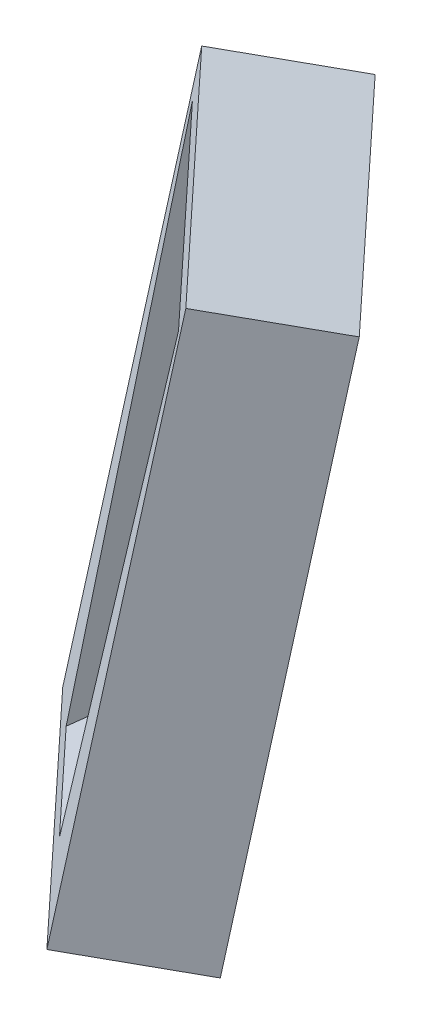
ISO-10303-21;
HEADER;
FILE_DESCRIPTION(('STEP AP214'),'2;1');
FILE_NAME('part.step','',(''),(''),'','','');
FILE_SCHEMA(('AUTOMOTIVE_DESIGN { 1 0 10303 214 1 1 1 1 }'));
ENDSEC;
DATA;
#1=APPLICATION_CONTEXT('core data for automotive mechanical design processes');
#2=APPLICATION_PROTOCOL_DEFINITION('international standard','automotive_design',2000,#1);
#3=PRODUCT_CONTEXT('',#1,'mechanical');
#4=PRODUCT('Part','Part','',(#3));
#5=PRODUCT_RELATED_PRODUCT_CATEGORY('part','',(#4));
#6=PRODUCT_DEFINITION_FORMATION('','',#4);
#7=PRODUCT_DEFINITION_CONTEXT('part definition',#1,'design');
#8=PRODUCT_DEFINITION('design','',#6,#7);
#9=PRODUCT_DEFINITION_SHAPE('','',#8);
#10=(LENGTH_UNIT() NAMED_UNIT(*) SI_UNIT(.MILLI.,.METRE.));
#11=(NAMED_UNIT(*) PLANE_ANGLE_UNIT() SI_UNIT($,.RADIAN.));
#12=(NAMED_UNIT(*) SI_UNIT($,.STERADIAN.) SOLID_ANGLE_UNIT());
#13=UNCERTAINTY_MEASURE_WITH_UNIT(LENGTH_MEASURE(1.E-05),#10,'distance_accuracy_value','');
#14=(GEOMETRIC_REPRESENTATION_CONTEXT(3) GLOBAL_UNCERTAINTY_ASSIGNED_CONTEXT((#13)) GLOBAL_UNIT_ASSIGNED_CONTEXT((#10,
#11,#12)) REPRESENTATION_CONTEXT('',''));
#15=CARTESIAN_POINT('',(0.,0.,0.));
#16=DIRECTION('',(0.,0.,1.));
#17=DIRECTION('',(1.,0.,0.));
#18=AXIS2_PLACEMENT_3D('',#15,#16,#17);
#19=CARTESIAN_POINT('',(18.6546782727136,-4.4975817974709,-17.3957689163492));
#20=DIRECTION('',(-0.720242795548749,0.173648177666931,0.671637272531146));
#21=DIRECTION('',(0.681998360062485,0.,0.731353701619184));
#22=AXIS2_PLACEMENT_3D('',#19,#20,#21);
#23=PLANE('',#22);
#24=DIRECTION('',(-0.126998237516135,-0.984807753012208,0.118427772396686));
#25=VECTOR('',#24,1.);
#26=CARTESIAN_POINT('',(-8.13275820855272,-83.6255594174478,-25.6636677477316));
#27=LINE('',#26,#25);
#28=CARTESIAN_POINT('',(3.40947598664339,5.87868839597211,-36.4269752624856));
#29=VERTEX_POINT('',#28);
#30=CARTESIAN_POINT('',(-8.13275820855272,-83.6255594174478,-25.6636677477316));
#31=VERTEX_POINT('',#30);
#32=EDGE_CURVE('E158',#29,#31,#27,.T.);
#33=ORIENTED_EDGE('',*,*,#32,.T.);
#34=DIRECTION('',(0.681998360062485,0.,0.731353701619183));
#35=VECTOR('',#34,1.);
#36=CARTESIAN_POINT('',(27.0697806010197,-83.6255594174478,12.0864333850847));
#37=LINE('',#36,#35);
#38=CARTESIAN_POINT('',(27.0697806010197,-83.6255594174478,12.0864333850847));
#39=VERTEX_POINT('',#38);
#40=EDGE_CURVE('E156',#31,#39,#37,.T.);
#41=ORIENTED_EDGE('',*,*,#40,.T.);
#42=DIRECTION('',(0.126998237516135,0.984807753012208,-0.118427772396686));
#43=VECTOR('',#42,1.);
#44=CARTESIAN_POINT('',(27.0697806010197,-83.6255594174478,12.0864333850847));
#45=LINE('',#44,#43);
#46=CARTESIAN_POINT('',(38.6120147962158,5.87868839597211,1.32312587033079));
#47=VERTEX_POINT('',#46);
#48=EDGE_CURVE('E154',#39,#47,#45,.T.);
#49=ORIENTED_EDGE('',*,*,#48,.T.);
#50=DIRECTION('',(-0.681998360062485,0.,-0.731353701619183));
#51=VECTOR('',#50,1.);
#52=CARTESIAN_POINT('',(38.6120147962158,5.87868839597211,1.32312587033079));
#53=LINE('',#52,#51);
#54=EDGE_CURVE('E125',#47,#29,#53,.T.);
#55=ORIENTED_EDGE('',*,*,#54,.T.);
#56=EDGE_LOOP('',(#33,#41,#49,#55));
#57=FACE_BOUND('',#56,.T.);
#58=DIRECTION('',(-0.681998360062485,0.,-0.731353701619184));
#59=VECTOR('',#58,1.);
#60=CARTESIAN_POINT('',(9.11646443948094,-78.4616549733872,-8.50124062205317));
#61=LINE('',#60,#59);
#62=CARTESIAN_POINT('',(17.6758311591867,-78.4616549733873,0.677556425786284));
#63=VERTEX_POINT('',#62);
#64=CARTESIAN_POINT('',(2.74526071646667,-78.4616549733872,-15.3335201398067));
#65=VERTEX_POINT('',#64);
#66=EDGE_CURVE('E118',#63,#65,#61,.T.);
#67=ORIENTED_EDGE('',*,*,#66,.T.);
#68=DIRECTION('',(0.0273368689251121,0.974517168416114,-0.222640930782305));
#69=VECTOR('',#68,1.);
#70=CARTESIAN_POINT('',(4.74012263099706,-7.34790783376903,-31.5803666477192));
#71=LINE('',#70,#69);
#72=CARTESIAN_POINT('',(4.96169586738922,0.550835929358898,-33.3849358440648));
#73=VERTEX_POINT('',#72);
#74=EDGE_CURVE('E124',#65,#73,#71,.T.);
#75=ORIENTED_EDGE('',*,*,#74,.T.);
#76=DIRECTION('',(-0.681998360062485,0.,-0.731353701619184));
#77=VECTOR('',#76,1.);
#78=CARTESIAN_POINT('',(19.3057090465794,0.550835929358901,-18.002864934519));
#79=LINE('',#78,#77);
#80=CARTESIAN_POINT('',(35.8378852224596,0.550835929358904,-0.274276494888895));
#81=VERTEX_POINT('',#80);
#82=EDGE_CURVE('E128',#81,#73,#79,.T.);
#83=ORIENTED_EDGE('',*,*,#82,.F.);
#84=DIRECTION('',(0.224005512244216,0.974517168416118,-0.0117396314438858));
#85=VECTOR('',#84,1.);
#86=CARTESIAN_POINT('',(33.918627764174,-7.79873245836392,-0.173692473627682));
#87=LINE('',#86,#85);
#88=EDGE_CURVE('E111',#63,#81,#87,.T.);
#89=ORIENTED_EDGE('',*,*,#88,.F.);
#90=EDGE_LOOP('',(#67,#75,#83,#89));
#91=FACE_BOUND('',#90,.T.);
#92=ADVANCED_FACE('F45',(#57,#91),#23,.T.);
#93=CARTESIAN_POINT('',(-8.13275820855272,-83.6255594174478,-25.6636677477316));
#94=DIRECTION('',(0.681998360062485,0.,0.731353701619183));
#95=DIRECTION('',(0.731353701619183,0.,-0.681998360062485));
#96=AXIS2_PLACEMENT_3D('',#93,#94,#95);
#97=PLANE('',#96);
#98=DIRECTION('',(-0.126998237516135,-0.984807753012208,0.118427772396686));
#99=VECTOR('',#98,1.);
#100=CARTESIAN_POINT('',(6.27209770242226,-87.0985229707865,-39.0964131983546));
#101=LINE('',#100,#99);
#102=CARTESIAN_POINT('',(17.8143318976184,2.4057248426335,-49.8597207131085));
#103=VERTEX_POINT('',#102);
#104=CARTESIAN_POINT('',(6.27209770242226,-87.0985229707865,-39.0964131983546));
#105=VERTEX_POINT('',#104);
#106=EDGE_CURVE('E147',#103,#105,#101,.T.);
#107=ORIENTED_EDGE('',*,*,#106,.T.);
#108=DIRECTION('',(0.720242795548749,-0.173648177666931,-0.671637272531146));
#109=VECTOR('',#108,1.);
#110=CARTESIAN_POINT('',(-8.13275820855272,-83.6255594174478,-25.6636677477316));
#111=LINE('',#110,#109);
#112=EDGE_CURVE('E136',#31,#105,#111,.T.);
#113=ORIENTED_EDGE('',*,*,#112,.F.);
#114=ORIENTED_EDGE('',*,*,#32,.F.);
#115=DIRECTION('',(0.720242795548749,-0.173648177666931,-0.671637272531146));
#116=VECTOR('',#115,1.);
#117=CARTESIAN_POINT('',(3.40947598664339,5.87868839597211,-36.4269752624856));
#118=LINE('',#117,#116);
#119=EDGE_CURVE('E144',#29,#103,#118,.T.);
#120=ORIENTED_EDGE('',*,*,#119,.T.);
#121=EDGE_LOOP('',(#107,#113,#114,#120));
#122=FACE_BOUND('',#121,.T.);
#123=ADVANCED_FACE('F193',(#122),#97,.F.);
#124=CARTESIAN_POINT('',(27.0697806010197,-83.6255594174478,12.0864333850847));
#125=DIRECTION('',(0.126998237516135,0.984807753012208,-0.118427772396686));
#126=DIRECTION('',(-0.991787288091737,0.127898300143659,0.));
#127=AXIS2_PLACEMENT_3D('',#124,#125,#126);
#128=PLANE('',#127);
#129=DIRECTION('',(0.681998360062485,0.,0.731353701619183));
#130=VECTOR('',#129,1.);
#131=CARTESIAN_POINT('',(41.4746365119946,-87.0985229707865,-1.34631206553818));
#132=LINE('',#131,#130);
#133=CARTESIAN_POINT('',(41.4746365119946,-87.0985229707865,-1.34631206553818));
#134=VERTEX_POINT('',#133);
#135=EDGE_CURVE('E140',#105,#134,#132,.T.);
#136=ORIENTED_EDGE('',*,*,#135,.T.);
#137=DIRECTION('',(0.720242795548749,-0.173648177666931,-0.671637272531146));
#138=VECTOR('',#137,1.);
#139=CARTESIAN_POINT('',(27.0697806010197,-83.6255594174478,12.0864333850847));
#140=LINE('',#139,#138);
#141=EDGE_CURVE('E141',#39,#134,#140,.T.);
#142=ORIENTED_EDGE('',*,*,#141,.F.);
#143=ORIENTED_EDGE('',*,*,#40,.F.);
#144=ORIENTED_EDGE('',*,*,#112,.T.);
#145=EDGE_LOOP('',(#136,#142,#143,#144));
#146=FACE_BOUND('',#145,.T.);
#147=ADVANCED_FACE('F198',(#146),#128,.F.);
#148=CARTESIAN_POINT('',(27.0697806010197,-83.6255594174478,12.0864333850847));
#149=DIRECTION('',(-0.681998360062485,0.,-0.731353701619183));
#150=DIRECTION('',(-0.731353701619183,0.,0.681998360062485));
#151=AXIS2_PLACEMENT_3D('',#148,#149,#150);
#152=PLANE('',#151);
#153=DIRECTION('',(0.126998237516135,0.984807753012208,-0.118427772396686));
#154=VECTOR('',#153,1.);
#155=CARTESIAN_POINT('',(41.4746365119946,-87.0985229707865,-1.34631206553818));
#156=LINE('',#155,#154);
#157=CARTESIAN_POINT('',(53.0168707071907,2.4057248426335,-12.1096195802921));
#158=VERTEX_POINT('',#157);
#159=EDGE_CURVE('E139',#134,#158,#156,.T.);
#160=ORIENTED_EDGE('',*,*,#159,.T.);
#161=DIRECTION('',(0.720242795548749,-0.173648177666931,-0.671637272531146));
#162=VECTOR('',#161,1.);
#163=CARTESIAN_POINT('',(38.6120147962158,5.87868839597211,1.32312587033079));
#164=LINE('',#163,#162);
#165=EDGE_CURVE('E129',#47,#158,#164,.T.);
#166=ORIENTED_EDGE('',*,*,#165,.F.);
#167=ORIENTED_EDGE('',*,*,#48,.F.);
#168=ORIENTED_EDGE('',*,*,#141,.T.);
#169=EDGE_LOOP('',(#160,#166,#167,#168));
#170=FACE_BOUND('',#169,.T.);
#171=ADVANCED_FACE('F212',(#170),#152,.F.);
#172=CARTESIAN_POINT('',(38.6120147962158,5.87868839597211,1.32312587033079));
#173=DIRECTION('',(-0.126998237516135,-0.984807753012208,0.118427772396686));
#174=DIRECTION('',(0.991787288091737,-0.127898300143659,0.));
#175=AXIS2_PLACEMENT_3D('',#172,#173,#174);
#176=PLANE('',#175);
#177=DIRECTION('',(-0.681998360062485,0.,-0.731353701619183));
#178=VECTOR('',#177,1.);
#179=CARTESIAN_POINT('',(53.0168707071907,2.4057248426335,-12.1096195802921));
#180=LINE('',#179,#178);
#181=EDGE_CURVE('E132',#158,#103,#180,.T.);
#182=ORIENTED_EDGE('',*,*,#181,.T.);
#183=ORIENTED_EDGE('',*,*,#119,.F.);
#184=ORIENTED_EDGE('',*,*,#54,.F.);
#185=ORIENTED_EDGE('',*,*,#165,.T.);
#186=EDGE_LOOP('',(#182,#183,#184,#185));
#187=FACE_BOUND('',#186,.T.);
#188=ADVANCED_FACE('F189',(#187),#176,.F.);
#189=CARTESIAN_POINT('',(33.0595341836886,-7.97054535080951,-30.8285143669722));
#190=DIRECTION('',(-0.720242795548749,0.173648177666931,0.671637272531146));
#191=DIRECTION('',(0.681998360062485,0.,0.731353701619184));
#192=AXIS2_PLACEMENT_3D('',#189,#190,#191);
#193=PLANE('',#192);
#194=ORIENTED_EDGE('',*,*,#106,.F.);
#195=ORIENTED_EDGE('',*,*,#181,.F.);
#196=ORIENTED_EDGE('',*,*,#159,.F.);
#197=ORIENTED_EDGE('',*,*,#135,.F.);
#198=EDGE_LOOP('',(#194,#195,#196,#197));
#199=FACE_BOUND('',#198,.T.);
#200=ADVANCED_FACE('F185',(#199),#193,.F.);
#201=CARTESIAN_POINT('',(0.669916928654261,0.550835929358902,1.56879862528684));
#202=DIRECTION('',(0.052335956242972,0.,0.998629534754573));
#203=DIRECTION('',(0.998629534754573,0.,-0.052335956242972));
#204=AXIS2_PLACEMENT_3D('',#201,#202,#203);
#205=PLANE('',#204);
#206=ORIENTED_EDGE('',*,*,#88,.T.);
#207=DIRECTION('',(-0.998629534754573,0.,0.052335956242972));
#208=VECTOR('',#207,1.);
#209=CARTESIAN_POINT('',(0.669916928654261,0.550835929358902,1.56879862528684));
#210=LINE('',#209,#208);
#211=CARTESIAN_POINT('',(36.9201690402453,0.550835929358902,-0.330996586333041));
#212=VERTEX_POINT('',#211);
#213=EDGE_CURVE('E163',#212,#81,#210,.T.);
#214=ORIENTED_EDGE('',*,*,#213,.F.);
#215=CARTESIAN_POINT('',(36.9201690402453,0.550835929358902,-0.330996586333041));
#216=CARTESIAN_POINT('',(36.850387354924,-32.7451296873358,-0.327339483170722));
#217=CARTESIAN_POINT('',(31.7627781825146,-60.3724010335655,-0.0607091845845709));
#218=CARTESIAN_POINT('',(21.2638484056439,-78.4616549733873,0.489516409870112));
#219=B_SPLINE_CURVE_WITH_KNOTS('',3,(#215,#216,#217,#218),.UNSPECIFIED.,.F.,.F.,(4,4),(0.,1.),.UNSPECIFIED.);
#220=CARTESIAN_POINT('',(21.2638484056439,-78.4616549733872,0.489516409870111));
#221=VERTEX_POINT('',#220);
#222=EDGE_CURVE('E48',#212,#221,#219,.T.);
#223=ORIENTED_EDGE('',*,*,#222,.T.);
#224=DIRECTION('',(-0.998629534754573,0.,0.052335956242972));
#225=VECTOR('',#224,1.);
#226=CARTESIAN_POINT('',(0.669916928654261,-78.4616549733872,1.56879862528684));
#227=LINE('',#226,#225);
#228=EDGE_CURVE('E106',#221,#63,#227,.T.);
#229=ORIENTED_EDGE('',*,*,#228,.T.);
#230=EDGE_LOOP('',(#206,#214,#223,#229));
#231=FACE_BOUND('',#230,.T.);
#232=ADVANCED_FACE('F108',(#231),#205,.F.);
#233=CARTESIAN_POINT('',(0.669916928654261,0.550835929358902,1.56879862528684));
#234=DIRECTION('',(0.992546151641326,0.,0.121869343405117));
#235=DIRECTION('',(0.121869343405117,0.,-0.992546151641326));
#236=AXIS2_PLACEMENT_3D('',#233,#234,#235);
#237=PLANE('',#236);
#238=DIRECTION('',(-0.121869343405117,0.,0.992546151641326));
#239=VECTOR('',#238,1.);
#240=CARTESIAN_POINT('',(0.669916928654269,-78.4616549733872,1.56879862528685));
#241=LINE('',#240,#239);
#242=CARTESIAN_POINT('',(3.18313010720051,-78.4616549733872,-18.8996801481502));
#243=VERTEX_POINT('',#242);
#244=EDGE_CURVE('E121',#243,#65,#241,.T.);
#245=ORIENTED_EDGE('',*,*,#244,.F.);
#246=CARTESIAN_POINT('',(5.09377409425999,0.550835929358898,-34.4606266792933));
#247=CARTESIAN_POINT('',(5.08525817531724,-32.7451296873358,-34.3912700852709));
#248=CARTESIAN_POINT('',(4.46438369908241,-60.3724010335655,-29.3346532625259));
#249=CARTESIAN_POINT('',(3.18313010720051,-78.4616549733873,-18.8996801481502));
#250=B_SPLINE_CURVE_WITH_KNOTS('',3,(#246,#247,#248,#249),.UNSPECIFIED.,.F.,.F.,(4,4),(0.,1.),.UNSPECIFIED.);
#251=CARTESIAN_POINT('',(5.09377409425999,0.550835929358898,-34.4606266792933));
#252=VERTEX_POINT('',#251);
#253=EDGE_CURVE('E56',#252,#243,#250,.T.);
#254=ORIENTED_EDGE('',*,*,#253,.F.);
#255=DIRECTION('',(-0.121869343405117,0.,0.992546151641326));
#256=VECTOR('',#255,1.);
#257=CARTESIAN_POINT('',(0.669916928654261,0.550835929358902,1.56879862528684));
#258=LINE('',#257,#256);
#259=EDGE_CURVE('E114',#252,#73,#258,.T.);
#260=ORIENTED_EDGE('',*,*,#259,.T.);
#261=ORIENTED_EDGE('',*,*,#74,.F.);
#262=EDGE_LOOP('',(#245,#254,#260,#261));
#263=FACE_BOUND('',#262,.T.);
#264=ADVANCED_FACE('F181',(#263),#237,.T.);
#265=CARTESIAN_POINT('',(0.669916928654269,-78.4616549733872,1.56879862528685));
#266=DIRECTION('',(0.,1.,0.));
#267=DIRECTION('',(-0.998629534754573,0.,0.052335956242972));
#268=AXIS2_PLACEMENT_3D('',#265,#266,#267);
#269=PLANE('',#268);
#270=ORIENTED_EDGE('',*,*,#228,.F.);
#271=CARTESIAN_POINT('',(0.66991692865427,-78.4616549733872,1.56879862528684));
#272=DIRECTION('',(0.,-1.,0.));
#273=DIRECTION('',(0.998629534754573,0.,-0.052335956242972));
#274=AXIS2_PLACEMENT_3D('',#271,#272,#273);
#275=CIRCLE('',#274,20.6221934764336);
#276=EDGE_CURVE('E11',#243,#221,#275,.T.);
#277=ORIENTED_EDGE('',*,*,#276,.F.);
#278=ORIENTED_EDGE('',*,*,#244,.T.);
#279=ORIENTED_EDGE('',*,*,#66,.F.);
#280=EDGE_LOOP('',(#270,#277,#278,#279));
#281=FACE_BOUND('',#280,.T.);
#282=ADVANCED_FACE('F119',(#281),#269,.T.);
#283=CARTESIAN_POINT('',(0.669916928654261,0.550835929358898,1.56879862528684));
#284=DIRECTION('',(0.,1.,0.));
#285=DIRECTION('',(-0.998629534754573,0.,0.052335956242972));
#286=AXIS2_PLACEMENT_3D('',#283,#284,#285);
#287=PLANE('',#286);
#288=ORIENTED_EDGE('',*,*,#82,.T.);
#289=ORIENTED_EDGE('',*,*,#259,.F.);
#290=CARTESIAN_POINT('',(0.669916928654261,0.550835929358897,1.56879862528684));
#291=DIRECTION('',(0.,-1.,0.));
#292=DIRECTION('',(0.998629534754573,0.,-0.052335956242972));
#293=AXIS2_PLACEMENT_3D('',#290,#291,#292);
#294=CIRCLE('',#293,36.3);
#295=EDGE_CURVE('E161',#252,#212,#294,.T.);
#296=ORIENTED_EDGE('',*,*,#295,.T.);
#297=ORIENTED_EDGE('',*,*,#213,.T.);
#298=EDGE_LOOP('',(#288,#289,#296,#297));
#299=FACE_BOUND('',#298,.T.);
#300=ADVANCED_FACE('F179',(#299),#287,.F.);
#301=CARTESIAN_POINT('',(0.669916928654261,0.550835929358902,1.56879862528684));
#302=DIRECTION('',(0.,-1.,0.));
#303=AXIS1_PLACEMENT('',#301,#302);
#304=SURFACE_OF_REVOLUTION('',#250,#303);
#305=ORIENTED_EDGE('',*,*,#295,.F.);
#306=ORIENTED_EDGE('',*,*,#253,.T.);
#307=ORIENTED_EDGE('',*,*,#276,.T.);
#308=ORIENTED_EDGE('',*,*,#222,.F.);
#309=EDGE_LOOP('',(#305,#306,#307,#308));
#310=FACE_BOUND('',#309,.T.);
#311=ADVANCED_FACE('F175',(#310),#304,.F.);
#312=CLOSED_SHELL('',(#92,#123,#147,#171,#188,#200,#232,#264,#282,#300,#311));
#313=MANIFOLD_SOLID_BREP('B2',#312);
#314=ADVANCED_BREP_SHAPE_REPRESENTATION('',(#18,#313),#14);
#315=SHAPE_DEFINITION_REPRESENTATION(#9,#314);
ENDSEC;
END-ISO-10303-21;
